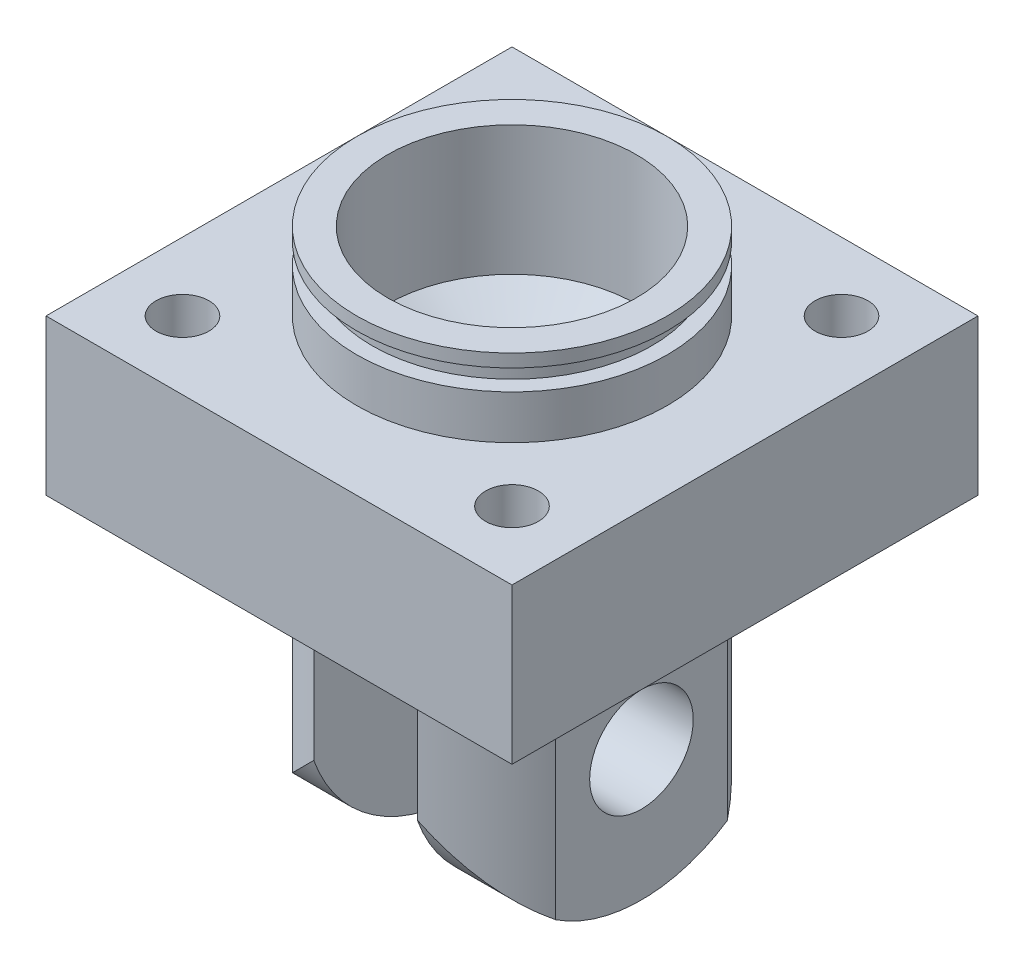
ISO-10303-21;
HEADER;
FILE_DESCRIPTION(('STEP AP214'),'2;1');
FILE_NAME('part.step','',(''),(''),'','','');
FILE_SCHEMA(('AUTOMOTIVE_DESIGN { 1 0 10303 214 1 1 1 1 }'));
ENDSEC;
DATA;
#1=APPLICATION_CONTEXT('core data for automotive mechanical design processes');
#2=APPLICATION_PROTOCOL_DEFINITION('international standard','automotive_design',2000,#1);
#3=PRODUCT_CONTEXT('',#1,'mechanical');
#4=PRODUCT('Part','Part','',(#3));
#5=PRODUCT_RELATED_PRODUCT_CATEGORY('part','',(#4));
#6=PRODUCT_DEFINITION_FORMATION('','',#4);
#7=PRODUCT_DEFINITION_CONTEXT('part definition',#1,'design');
#8=PRODUCT_DEFINITION('design','',#6,#7);
#9=PRODUCT_DEFINITION_SHAPE('','',#8);
#10=(LENGTH_UNIT() NAMED_UNIT(*) SI_UNIT(.MILLI.,.METRE.));
#11=(NAMED_UNIT(*) PLANE_ANGLE_UNIT() SI_UNIT($,.RADIAN.));
#12=(NAMED_UNIT(*) SI_UNIT($,.STERADIAN.) SOLID_ANGLE_UNIT());
#13=UNCERTAINTY_MEASURE_WITH_UNIT(LENGTH_MEASURE(1.E-05),#10,'distance_accuracy_value','');
#14=(GEOMETRIC_REPRESENTATION_CONTEXT(3) GLOBAL_UNCERTAINTY_ASSIGNED_CONTEXT((#13)) GLOBAL_UNIT_ASSIGNED_CONTEXT((#10,
#11,#12)) REPRESENTATION_CONTEXT('',''));
#15=CARTESIAN_POINT('',(0.,0.,0.));
#16=DIRECTION('',(0.,0.,1.));
#17=DIRECTION('',(1.,0.,0.));
#18=AXIS2_PLACEMENT_3D('',#15,#16,#17);
#19=CARTESIAN_POINT('',(0.,-70.2,0.));
#20=DIRECTION('',(0.,1.,0.));
#21=DIRECTION('',(0.,0.,1.));
#22=AXIS2_PLACEMENT_3D('',#19,#20,#21);
#23=CYLINDRICAL_SURFACE('',#22,30.);
#24=CARTESIAN_POINT('',(0.,-40.2,0.));
#25=DIRECTION('',(0.707106781186548,0.707106781186547,0.));
#26=DIRECTION('',(-0.707106781186548,0.707106781186547,0.));
#27=AXIS2_PLACEMENT_3D('',#24,#25,#26);
#28=ELLIPSE('',#27,42.4264068711928,30.);
#29=CARTESIAN_POINT('',(25.,-65.2,16.583123951777));
#30=VERTEX_POINT('',#29);
#31=CARTESIAN_POINT('',(10.,-50.2,28.2842712474619));
#32=VERTEX_POINT('',#31);
#33=EDGE_CURVE('E210',#30,#32,#28,.F.);
#34=ORIENTED_EDGE('',*,*,#33,.F.);
#35=DIRECTION('',(0.,1.,0.));
#36=VECTOR('',#35,1.);
#37=CARTESIAN_POINT('',(25.,-70.2,16.583123951777));
#38=LINE('',#37,#36);
#39=CARTESIAN_POINT('',(25.,-15.,16.583123951777));
#40=VERTEX_POINT('',#39);
#41=EDGE_CURVE('E253',#30,#40,#38,.T.);
#42=ORIENTED_EDGE('',*,*,#41,.T.);
#43=CARTESIAN_POINT('',(0.,-15.,0.));
#44=DIRECTION('',(0.,-1.,0.));
#45=DIRECTION('',(0.,0.,-1.));
#46=AXIS2_PLACEMENT_3D('',#43,#44,#45);
#47=CIRCLE('',#46,30.);
#48=CARTESIAN_POINT('',(10.,-15.,28.2842712474619));
#49=VERTEX_POINT('',#48);
#50=EDGE_CURVE('E284',#40,#49,#47,.T.);
#51=ORIENTED_EDGE('',*,*,#50,.T.);
#52=DIRECTION('',(0.,1.,0.));
#53=VECTOR('',#52,1.);
#54=CARTESIAN_POINT('',(10.,-70.2,28.2842712474619));
#55=LINE('',#54,#53);
#56=EDGE_CURVE('E273',#49,#32,#55,.F.);
#57=ORIENTED_EDGE('',*,*,#56,.T.);
#58=EDGE_LOOP('',(#34,#42,#51,#57));
#59=FACE_BOUND('',#58,.T.);
#60=ADVANCED_FACE('F46',(#59),#23,.T.);
#61=CARTESIAN_POINT('',(0.,-40.2,0.));
#62=DIRECTION('',(-0.707106781186548,0.707106781186547,0.));
#63=DIRECTION('',(0.707106781186548,0.707106781186547,0.));
#64=AXIS2_PLACEMENT_3D('',#61,#62,#63);
#65=ELLIPSE('',#64,42.4264068711928,30.);
#66=CARTESIAN_POINT('',(-25.,-65.2,-16.583123951777));
#67=VERTEX_POINT('',#66);
#68=CARTESIAN_POINT('',(-10.,-50.2,-28.2842712474619));
#69=VERTEX_POINT('',#68);
#70=EDGE_CURVE('E223',#67,#69,#65,.F.);
#71=ORIENTED_EDGE('',*,*,#70,.F.);
#72=DIRECTION('',(0.,1.,0.));
#73=VECTOR('',#72,1.);
#74=CARTESIAN_POINT('',(-25.,-70.2,-16.583123951777));
#75=LINE('',#74,#73);
#76=CARTESIAN_POINT('',(-25.,-15.,-16.583123951777));
#77=VERTEX_POINT('',#76);
#78=EDGE_CURVE('E242',#67,#77,#75,.T.);
#79=ORIENTED_EDGE('',*,*,#78,.T.);
#80=CARTESIAN_POINT('',(-10.,-15.,-28.2842712474619));
#81=VERTEX_POINT('',#80);
#82=EDGE_CURVE('E302',#77,#81,#47,.T.);
#83=ORIENTED_EDGE('',*,*,#82,.T.);
#84=DIRECTION('',(0.,1.,0.));
#85=VECTOR('',#84,1.);
#86=CARTESIAN_POINT('',(-10.,-70.2,-28.2842712474619));
#87=LINE('',#86,#85);
#88=EDGE_CURVE('E265',#81,#69,#87,.F.);
#89=ORIENTED_EDGE('',*,*,#88,.T.);
#90=EDGE_LOOP('',(#71,#79,#83,#89));
#91=FACE_BOUND('',#90,.T.);
#92=ADVANCED_FACE('F386',(#91),#23,.T.);
#93=CARTESIAN_POINT('',(0.,-40.2,0.));
#94=DIRECTION('',(0.707106781186548,0.707106781186547,0.));
#95=DIRECTION('',(-0.707106781186548,0.707106781186547,0.));
#96=AXIS2_PLACEMENT_3D('',#93,#94,#95);
#97=ELLIPSE('',#96,42.4264068711928,30.);
#98=CARTESIAN_POINT('',(10.,-50.2,-28.2842712474619));
#99=VERTEX_POINT('',#98);
#100=CARTESIAN_POINT('',(25.,-65.2,-16.583123951777));
#101=VERTEX_POINT('',#100);
#102=EDGE_CURVE('E206',#99,#101,#97,.F.);
#103=ORIENTED_EDGE('',*,*,#102,.F.);
#104=DIRECTION('',(0.,1.,0.));
#105=VECTOR('',#104,1.);
#106=CARTESIAN_POINT('',(10.,-70.2,-28.2842712474619));
#107=LINE('',#106,#105);
#108=CARTESIAN_POINT('',(10.,-15.,-28.2842712474619));
#109=VERTEX_POINT('',#108);
#110=EDGE_CURVE('E277',#99,#109,#107,.T.);
#111=ORIENTED_EDGE('',*,*,#110,.T.);
#112=CARTESIAN_POINT('',(25.,-15.,-16.583123951777));
#113=VERTEX_POINT('',#112);
#114=EDGE_CURVE('E57',#109,#113,#47,.T.);
#115=ORIENTED_EDGE('',*,*,#114,.T.);
#116=DIRECTION('',(0.,1.,0.));
#117=VECTOR('',#116,1.);
#118=CARTESIAN_POINT('',(25.,-70.2,-16.583123951777));
#119=LINE('',#118,#117);
#120=EDGE_CURVE('E249',#113,#101,#119,.F.);
#121=ORIENTED_EDGE('',*,*,#120,.T.);
#122=EDGE_LOOP('',(#103,#111,#115,#121));
#123=FACE_BOUND('',#122,.T.);
#124=ADVANCED_FACE('F418',(#123),#23,.T.);
#125=CARTESIAN_POINT('',(0.,-40.2,0.));
#126=DIRECTION('',(-0.707106781186548,0.707106781186547,0.));
#127=DIRECTION('',(0.707106781186548,0.707106781186547,0.));
#128=AXIS2_PLACEMENT_3D('',#125,#126,#127);
#129=ELLIPSE('',#128,42.4264068711928,30.);
#130=CARTESIAN_POINT('',(-10.,-50.2,28.2842712474619));
#131=VERTEX_POINT('',#130);
#132=CARTESIAN_POINT('',(-25.,-65.2,16.583123951777));
#133=VERTEX_POINT('',#132);
#134=EDGE_CURVE('E219',#131,#133,#129,.F.);
#135=ORIENTED_EDGE('',*,*,#134,.F.);
#136=DIRECTION('',(0.,1.,0.));
#137=VECTOR('',#136,1.);
#138=CARTESIAN_POINT('',(-10.,-70.2,28.2842712474619));
#139=LINE('',#138,#137);
#140=CARTESIAN_POINT('',(-10.,-15.,28.2842712474619));
#141=VERTEX_POINT('',#140);
#142=EDGE_CURVE('E269',#131,#141,#139,.T.);
#143=ORIENTED_EDGE('',*,*,#142,.T.);
#144=CARTESIAN_POINT('',(-25.,-15.,16.583123951777));
#145=VERTEX_POINT('',#144);
#146=EDGE_CURVE('E285',#141,#145,#47,.T.);
#147=ORIENTED_EDGE('',*,*,#146,.T.);
#148=DIRECTION('',(0.,1.,0.));
#149=VECTOR('',#148,1.);
#150=CARTESIAN_POINT('',(-25.,-70.2,16.583123951777));
#151=LINE('',#150,#149);
#152=EDGE_CURVE('E238',#145,#133,#151,.F.);
#153=ORIENTED_EDGE('',*,*,#152,.T.);
#154=EDGE_LOOP('',(#135,#143,#147,#153));
#155=FACE_BOUND('',#154,.T.);
#156=ADVANCED_FACE('F376',(#155),#23,.T.);
#157=CARTESIAN_POINT('',(10.,-15.,32.1559805024373));
#158=DIRECTION('',(1.,0.,0.));
#159=DIRECTION('',(0.,0.,-1.));
#160=AXIS2_PLACEMENT_3D('',#157,#158,#159);
#161=PLANE('',#160);
#162=CARTESIAN_POINT('',(10.,-45.,0.));
#163=DIRECTION('',(1.,0.,0.));
#164=DIRECTION('',(0.,0.,-1.));
#165=AXIS2_PLACEMENT_3D('',#162,#163,#164);
#166=CIRCLE('',#165,10.);
#167=CARTESIAN_POINT('',(10.,-45.,-10.));
#168=VERTEX_POINT('',#167);
#169=EDGE_CURVE('E272',#168,#168,#166,.F.);
#170=ORIENTED_EDGE('',*,*,#169,.F.);
#171=EDGE_LOOP('',(#170));
#172=FACE_BOUND('',#171,.T.);
#173=CARTESIAN_POINT('',(10.,-40.2,0.));
#174=DIRECTION('',(1.,0.,0.));
#175=DIRECTION('',(0.,0.,-1.));
#176=AXIS2_PLACEMENT_3D('',#173,#174,#175);
#177=CIRCLE('',#176,30.);
#178=EDGE_CURVE('E213',#32,#99,#177,.T.);
#179=ORIENTED_EDGE('',*,*,#178,.F.);
#180=ORIENTED_EDGE('',*,*,#56,.F.);
#181=DIRECTION('',(0.,0.,1.));
#182=VECTOR('',#181,1.);
#183=CARTESIAN_POINT('',(10.,-15.,32.1559805024373));
#184=LINE('',#183,#182);
#185=EDGE_CURVE('E256',#109,#49,#184,.T.);
#186=ORIENTED_EDGE('',*,*,#185,.F.);
#187=ORIENTED_EDGE('',*,*,#110,.F.);
#188=EDGE_LOOP('',(#179,#180,#186,#187));
#189=FACE_BOUND('',#188,.T.);
#190=ADVANCED_FACE('F423',(#172,#189),#161,.F.);
#191=CARTESIAN_POINT('',(-10.,-15.,32.1559805024373));
#192=DIRECTION('',(-1.,0.,0.));
#193=DIRECTION('',(0.,0.,1.));
#194=AXIS2_PLACEMENT_3D('',#191,#192,#193);
#195=PLANE('',#194);
#196=CARTESIAN_POINT('',(-10.,-45.,0.));
#197=DIRECTION('',(-1.,0.,0.));
#198=DIRECTION('',(0.,0.,1.));
#199=AXIS2_PLACEMENT_3D('',#196,#197,#198);
#200=CIRCLE('',#199,10.);
#201=CARTESIAN_POINT('',(-10.,-45.,10.));
#202=VERTEX_POINT('',#201);
#203=EDGE_CURVE('E264',#202,#202,#200,.F.);
#204=ORIENTED_EDGE('',*,*,#203,.F.);
#205=EDGE_LOOP('',(#204));
#206=FACE_BOUND('',#205,.T.);
#207=CARTESIAN_POINT('',(-10.,-40.2,0.));
#208=DIRECTION('',(-1.,0.,0.));
#209=DIRECTION('',(0.,0.,1.));
#210=AXIS2_PLACEMENT_3D('',#207,#208,#209);
#211=CIRCLE('',#210,30.);
#212=EDGE_CURVE('E226',#69,#131,#211,.T.);
#213=ORIENTED_EDGE('',*,*,#212,.F.);
#214=ORIENTED_EDGE('',*,*,#88,.F.);
#215=DIRECTION('',(0.,0.,-1.));
#216=VECTOR('',#215,1.);
#217=CARTESIAN_POINT('',(-10.,-15.,32.1559805024373));
#218=LINE('',#217,#216);
#219=EDGE_CURVE('E260',#141,#81,#218,.T.);
#220=ORIENTED_EDGE('',*,*,#219,.F.);
#221=ORIENTED_EDGE('',*,*,#142,.F.);
#222=EDGE_LOOP('',(#213,#214,#220,#221));
#223=FACE_BOUND('',#222,.T.);
#224=ADVANCED_FACE('F364',(#206,#223),#195,.F.);
#225=CARTESIAN_POINT('',(-25.,-75.,-36.8353955755532));
#226=DIRECTION('',(1.,0.,0.));
#227=DIRECTION('',(0.,0.,-1.));
#228=AXIS2_PLACEMENT_3D('',#225,#226,#227);
#229=PLANE('',#228);
#230=CARTESIAN_POINT('',(-25.,-45.,0.));
#231=DIRECTION('',(1.,0.,0.));
#232=DIRECTION('',(0.,0.,-1.));
#233=AXIS2_PLACEMENT_3D('',#230,#231,#232);
#234=CIRCLE('',#233,10.);
#235=CARTESIAN_POINT('',(-25.,-45.,-10.));
#236=VERTEX_POINT('',#235);
#237=EDGE_CURVE('E237',#236,#236,#234,.F.);
#238=ORIENTED_EDGE('',*,*,#237,.F.);
#239=EDGE_LOOP('',(#238));
#240=FACE_BOUND('',#239,.T.);
#241=CARTESIAN_POINT('',(-25.,-40.2,0.));
#242=DIRECTION('',(1.,0.,0.));
#243=DIRECTION('',(0.,0.,-1.));
#244=AXIS2_PLACEMENT_3D('',#241,#242,#243);
#245=CIRCLE('',#244,30.);
#246=EDGE_CURVE('E216',#133,#67,#245,.T.);
#247=ORIENTED_EDGE('',*,*,#246,.F.);
#248=ORIENTED_EDGE('',*,*,#152,.F.);
#249=DIRECTION('',(0.,0.,-1.));
#250=VECTOR('',#249,1.);
#251=CARTESIAN_POINT('',(-25.,-15.,-36.8353955755532));
#252=LINE('',#251,#250);
#253=EDGE_CURVE('E233',#145,#77,#252,.T.);
#254=ORIENTED_EDGE('',*,*,#253,.T.);
#255=ORIENTED_EDGE('',*,*,#78,.F.);
#256=EDGE_LOOP('',(#247,#248,#254,#255));
#257=FACE_BOUND('',#256,.T.);
#258=ADVANCED_FACE('F360',(#240,#257),#229,.F.);
#259=CARTESIAN_POINT('',(25.,-75.,-36.8353955755532));
#260=DIRECTION('',(-1.,0.,0.));
#261=DIRECTION('',(0.,0.,1.));
#262=AXIS2_PLACEMENT_3D('',#259,#260,#261);
#263=PLANE('',#262);
#264=CARTESIAN_POINT('',(25.,-45.,0.));
#265=DIRECTION('',(-1.,0.,0.));
#266=DIRECTION('',(0.,0.,1.));
#267=AXIS2_PLACEMENT_3D('',#264,#265,#266);
#268=CIRCLE('',#267,10.);
#269=CARTESIAN_POINT('',(25.,-45.,10.));
#270=VERTEX_POINT('',#269);
#271=EDGE_CURVE('E245',#270,#270,#268,.F.);
#272=ORIENTED_EDGE('',*,*,#271,.F.);
#273=EDGE_LOOP('',(#272));
#274=FACE_BOUND('',#273,.T.);
#275=CARTESIAN_POINT('',(25.,-40.2,0.));
#276=DIRECTION('',(-1.,0.,0.));
#277=DIRECTION('',(0.,0.,1.));
#278=AXIS2_PLACEMENT_3D('',#275,#276,#277);
#279=CIRCLE('',#278,30.);
#280=EDGE_CURVE('E12',#101,#30,#279,.T.);
#281=ORIENTED_EDGE('',*,*,#280,.F.);
#282=ORIENTED_EDGE('',*,*,#120,.F.);
#283=DIRECTION('',(0.,0.,1.));
#284=VECTOR('',#283,1.);
#285=CARTESIAN_POINT('',(25.,-15.,-36.8353955755532));
#286=LINE('',#285,#284);
#287=EDGE_CURVE('E229',#113,#40,#286,.T.);
#288=ORIENTED_EDGE('',*,*,#287,.T.);
#289=ORIENTED_EDGE('',*,*,#41,.F.);
#290=EDGE_LOOP('',(#281,#282,#288,#289));
#291=FACE_BOUND('',#290,.T.);
#292=ADVANCED_FACE('F363',(#274,#291),#263,.F.);
#293=CARTESIAN_POINT('',(-45.,-45.,0.));
#294=DIRECTION('',(1.,0.,0.));
#295=DIRECTION('',(0.,0.,-1.));
#296=AXIS2_PLACEMENT_3D('',#293,#294,#295);
#297=CYLINDRICAL_SURFACE('',#296,10.);
#298=ORIENTED_EDGE('',*,*,#271,.T.);
#299=EDGE_LOOP('',(#298));
#300=FACE_BOUND('',#299,.T.);
#301=ORIENTED_EDGE('',*,*,#169,.T.);
#302=EDGE_LOOP('',(#301));
#303=FACE_BOUND('',#302,.T.);
#304=ADVANCED_FACE('F411',(#300,#303),#297,.F.);
#305=CARTESIAN_POINT('',(-45.,15.,45.));
#306=DIRECTION('',(0.,0.,-1.));
#307=DIRECTION('',(-1.,0.,0.));
#308=AXIS2_PLACEMENT_3D('',#305,#306,#307);
#309=PLANE('',#308);
#310=DIRECTION('',(1.,0.,0.));
#311=VECTOR('',#310,1.);
#312=CARTESIAN_POINT('',(-45.,-15.,45.));
#313=LINE('',#312,#311);
#314=CARTESIAN_POINT('',(-45.,-15.,45.));
#315=VERTEX_POINT('',#314);
#316=CARTESIAN_POINT('',(45.,-15.,45.));
#317=VERTEX_POINT('',#316);
#318=EDGE_CURVE('E307',#315,#317,#313,.T.);
#319=ORIENTED_EDGE('',*,*,#318,.T.);
#320=DIRECTION('',(0.,-1.,0.));
#321=VECTOR('',#320,1.);
#322=CARTESIAN_POINT('',(45.,15.,45.));
#323=LINE('',#322,#321);
#324=CARTESIAN_POINT('',(45.,15.,45.));
#325=VERTEX_POINT('',#324);
#326=EDGE_CURVE('E311',#325,#317,#323,.T.);
#327=ORIENTED_EDGE('',*,*,#326,.F.);
#328=DIRECTION('',(1.,0.,0.));
#329=VECTOR('',#328,1.);
#330=CARTESIAN_POINT('',(-45.,15.,45.));
#331=LINE('',#330,#329);
#332=CARTESIAN_POINT('',(-45.,15.,45.));
#333=VERTEX_POINT('',#332);
#334=EDGE_CURVE('E90',#333,#325,#331,.T.);
#335=ORIENTED_EDGE('',*,*,#334,.F.);
#336=DIRECTION('',(0.,-1.,0.));
#337=VECTOR('',#336,1.);
#338=CARTESIAN_POINT('',(-45.,15.,45.));
#339=LINE('',#338,#337);
#340=EDGE_CURVE('E324',#333,#315,#339,.T.);
#341=ORIENTED_EDGE('',*,*,#340,.T.);
#342=EDGE_LOOP('',(#319,#327,#335,#341));
#343=FACE_BOUND('',#342,.T.);
#344=ADVANCED_FACE('F48',(#343),#309,.F.);
#345=CARTESIAN_POINT('',(45.,15.,-45.));
#346=DIRECTION('',(1.,0.,0.));
#347=DIRECTION('',(0.,0.,-1.));
#348=AXIS2_PLACEMENT_3D('',#345,#346,#347);
#349=PLANE('',#348);
#350=DIRECTION('',(0.,0.,1.));
#351=VECTOR('',#350,1.);
#352=CARTESIAN_POINT('',(45.,-15.,-45.));
#353=LINE('',#352,#351);
#354=CARTESIAN_POINT('',(45.,-15.,-45.));
#355=VERTEX_POINT('',#354);
#356=EDGE_CURVE('E328',#355,#317,#353,.T.);
#357=ORIENTED_EDGE('',*,*,#356,.F.);
#358=DIRECTION('',(0.,-1.,0.));
#359=VECTOR('',#358,1.);
#360=CARTESIAN_POINT('',(45.,15.,-45.));
#361=LINE('',#360,#359);
#362=CARTESIAN_POINT('',(45.,15.,-45.));
#363=VERTEX_POINT('',#362);
#364=EDGE_CURVE('E342',#363,#355,#361,.T.);
#365=ORIENTED_EDGE('',*,*,#364,.F.);
#366=DIRECTION('',(0.,0.,1.));
#367=VECTOR('',#366,1.);
#368=CARTESIAN_POINT('',(45.,15.,-45.));
#369=LINE('',#368,#367);
#370=EDGE_CURVE('E314',#363,#325,#369,.T.);
#371=ORIENTED_EDGE('',*,*,#370,.T.);
#372=ORIENTED_EDGE('',*,*,#326,.T.);
#373=EDGE_LOOP('',(#357,#365,#371,#372));
#374=FACE_BOUND('',#373,.T.);
#375=ADVANCED_FACE('F403',(#374),#349,.T.);
#376=CARTESIAN_POINT('',(-45.,15.,-45.));
#377=DIRECTION('',(0.,0.,-1.));
#378=DIRECTION('',(-1.,0.,0.));
#379=AXIS2_PLACEMENT_3D('',#376,#377,#378);
#380=PLANE('',#379);
#381=CARTESIAN_POINT('',(0.,0.,-45.));
#382=DIRECTION('',(0.,0.,-1.));
#383=DIRECTION('',(-1.,0.,0.));
#384=AXIS2_PLACEMENT_3D('',#381,#382,#383);
#385=CIRCLE('',#384,7.24999999999999);
#386=CARTESIAN_POINT('',(-7.24999999999999,0.,-45.));
#387=VERTEX_POINT('',#386);
#388=EDGE_CURVE('E796',#387,#387,#385,.T.);
#389=ORIENTED_EDGE('',*,*,#388,.F.);
#390=EDGE_LOOP('',(#389));
#391=FACE_BOUND('',#390,.T.);
#392=DIRECTION('',(1.,0.,0.));
#393=VECTOR('',#392,1.);
#394=CARTESIAN_POINT('',(-45.,-15.,-45.));
#395=LINE('',#394,#393);
#396=CARTESIAN_POINT('',(-45.,-15.,-45.));
#397=VERTEX_POINT('',#396);
#398=EDGE_CURVE('E332',#397,#355,#395,.T.);
#399=ORIENTED_EDGE('',*,*,#398,.F.);
#400=DIRECTION('',(0.,-1.,0.));
#401=VECTOR('',#400,1.);
#402=CARTESIAN_POINT('',(-45.,15.,-45.));
#403=LINE('',#402,#401);
#404=CARTESIAN_POINT('',(-45.,15.,-45.));
#405=VERTEX_POINT('',#404);
#406=EDGE_CURVE('E82',#405,#397,#403,.T.);
#407=ORIENTED_EDGE('',*,*,#406,.F.);
#408=DIRECTION('',(1.,0.,0.));
#409=VECTOR('',#408,1.);
#410=CARTESIAN_POINT('',(-45.,15.,-45.));
#411=LINE('',#410,#409);
#412=EDGE_CURVE('E318',#405,#363,#411,.T.);
#413=ORIENTED_EDGE('',*,*,#412,.T.);
#414=ORIENTED_EDGE('',*,*,#364,.T.);
#415=EDGE_LOOP('',(#399,#407,#413,#414));
#416=FACE_BOUND('',#415,.T.);
#417=ADVANCED_FACE('F401',(#391,#416),#380,.T.);
#418=CARTESIAN_POINT('',(-45.,15.,-45.));
#419=DIRECTION('',(1.,0.,0.));
#420=DIRECTION('',(0.,0.,-1.));
#421=AXIS2_PLACEMENT_3D('',#418,#419,#420);
#422=PLANE('',#421);
#423=DIRECTION('',(0.,0.,1.));
#424=VECTOR('',#423,1.);
#425=CARTESIAN_POINT('',(-45.,-15.,-45.));
#426=LINE('',#425,#424);
#427=EDGE_CURVE('E85',#397,#315,#426,.T.);
#428=ORIENTED_EDGE('',*,*,#427,.T.);
#429=ORIENTED_EDGE('',*,*,#340,.F.);
#430=DIRECTION('',(0.,0.,1.));
#431=VECTOR('',#430,1.);
#432=CARTESIAN_POINT('',(-45.,15.,-45.));
#433=LINE('',#432,#431);
#434=EDGE_CURVE('E65',#405,#333,#433,.T.);
#435=ORIENTED_EDGE('',*,*,#434,.F.);
#436=ORIENTED_EDGE('',*,*,#406,.T.);
#437=EDGE_LOOP('',(#428,#429,#435,#436));
#438=FACE_BOUND('',#437,.T.);
#439=ADVANCED_FACE('F399',(#438),#422,.F.);
#440=CARTESIAN_POINT('',(0.,15.,0.));
#441=DIRECTION('',(0.,-1.,0.));
#442=DIRECTION('',(0.,0.,-1.));
#443=AXIS2_PLACEMENT_3D('',#440,#441,#442);
#444=PLANE('',#443);
#445=CARTESIAN_POINT('',(-31.8198051533943,15.,-31.819805153395));
#446=DIRECTION('',(0.,1.,0.));
#447=DIRECTION('',(0.,0.,1.));
#448=AXIS2_PLACEMENT_3D('',#445,#446,#447);
#449=CIRCLE('',#448,5.1);
#450=CARTESIAN_POINT('',(-31.8198051533943,15.,-26.719805153395));
#451=VERTEX_POINT('',#450);
#452=EDGE_CURVE('E167',#451,#451,#449,.T.);
#453=ORIENTED_EDGE('',*,*,#452,.F.);
#454=EDGE_LOOP('',(#453));
#455=FACE_BOUND('',#454,.T.);
#456=CARTESIAN_POINT('',(-31.8198051533946,15.,31.8198051533947));
#457=DIRECTION('',(0.,1.,0.));
#458=DIRECTION('',(0.,0.,1.));
#459=AXIS2_PLACEMENT_3D('',#456,#457,#458);
#460=CIRCLE('',#459,5.1);
#461=CARTESIAN_POINT('',(-31.8198051533946,15.,36.9198051533946));
#462=VERTEX_POINT('',#461);
#463=EDGE_CURVE('E166',#462,#462,#460,.T.);
#464=ORIENTED_EDGE('',*,*,#463,.F.);
#465=EDGE_LOOP('',(#464));
#466=FACE_BOUND('',#465,.T.);
#467=CARTESIAN_POINT('',(31.8198051533945,15.,31.8198051533947));
#468=DIRECTION('',(0.,1.,0.));
#469=DIRECTION('',(0.,0.,1.));
#470=AXIS2_PLACEMENT_3D('',#467,#468,#469);
#471=CIRCLE('',#470,5.1);
#472=CARTESIAN_POINT('',(31.8198051533945,15.,36.9198051533947));
#473=VERTEX_POINT('',#472);
#474=EDGE_CURVE('E182',#473,#473,#471,.T.);
#475=ORIENTED_EDGE('',*,*,#474,.F.);
#476=EDGE_LOOP('',(#475));
#477=FACE_BOUND('',#476,.T.);
#478=CARTESIAN_POINT('',(31.8198051533946,15.,-31.8198051533947));
#479=DIRECTION('',(0.,1.,0.));
#480=DIRECTION('',(0.,0.,1.));
#481=AXIS2_PLACEMENT_3D('',#478,#479,#480);
#482=CIRCLE('',#481,5.1);
#483=CARTESIAN_POINT('',(31.8198051533946,15.,-26.7198051533946));
#484=VERTEX_POINT('',#483);
#485=EDGE_CURVE('E190',#484,#484,#482,.T.);
#486=ORIENTED_EDGE('',*,*,#485,.F.);
#487=EDGE_LOOP('',(#486));
#488=FACE_BOUND('',#487,.T.);
#489=CARTESIAN_POINT('',(0.,15.,0.));
#490=DIRECTION('',(0.,1.,0.));
#491=DIRECTION('',(0.,0.,1.));
#492=AXIS2_PLACEMENT_3D('',#489,#490,#491);
#493=CIRCLE('',#492,30.);
#494=CARTESIAN_POINT('',(0.,15.,30.));
#495=VERTEX_POINT('',#494);
#496=EDGE_CURVE('E303',#495,#495,#493,.T.);
#497=ORIENTED_EDGE('',*,*,#496,.F.);
#498=EDGE_LOOP('',(#497));
#499=FACE_BOUND('',#498,.T.);
#500=ORIENTED_EDGE('',*,*,#334,.T.);
#501=ORIENTED_EDGE('',*,*,#370,.F.);
#502=ORIENTED_EDGE('',*,*,#412,.F.);
#503=ORIENTED_EDGE('',*,*,#434,.T.);
#504=EDGE_LOOP('',(#500,#501,#502,#503));
#505=FACE_BOUND('',#504,.T.);
#506=ADVANCED_FACE('F392',(#455,#466,#477,#488,#499,#505),#444,.F.);
#507=CARTESIAN_POINT('',(0.,-15.,0.));
#508=DIRECTION('',(0.,-1.,0.));
#509=DIRECTION('',(0.,0.,-1.));
#510=AXIS2_PLACEMENT_3D('',#507,#508,#509);
#511=PLANE('',#510);
#512=ORIENTED_EDGE('',*,*,#50,.F.);
#513=ORIENTED_EDGE('',*,*,#287,.F.);
#514=ORIENTED_EDGE('',*,*,#114,.F.);
#515=ORIENTED_EDGE('',*,*,#185,.T.);
#516=EDGE_LOOP('',(#512,#513,#514,#515));
#517=FACE_BOUND('',#516,.T.);
#518=ORIENTED_EDGE('',*,*,#82,.F.);
#519=ORIENTED_EDGE('',*,*,#253,.F.);
#520=ORIENTED_EDGE('',*,*,#146,.F.);
#521=ORIENTED_EDGE('',*,*,#219,.T.);
#522=EDGE_LOOP('',(#518,#519,#520,#521));
#523=FACE_BOUND('',#522,.T.);
#524=ORIENTED_EDGE('',*,*,#318,.F.);
#525=ORIENTED_EDGE('',*,*,#427,.F.);
#526=ORIENTED_EDGE('',*,*,#398,.T.);
#527=ORIENTED_EDGE('',*,*,#356,.T.);
#528=EDGE_LOOP('',(#524,#525,#526,#527));
#529=FACE_BOUND('',#528,.T.);
#530=ADVANCED_FACE('F388',(#517,#523,#529),#511,.T.);
#531=CARTESIAN_POINT('',(0.,23.5,0.));
#532=DIRECTION('',(0.,-1.,0.));
#533=DIRECTION('',(0.,0.,-1.));
#534=AXIS2_PLACEMENT_3D('',#531,#532,#533);
#535=CYLINDRICAL_SURFACE('',#534,30.);
#536=CARTESIAN_POINT('',(0.,23.5,0.));
#537=DIRECTION('',(0.,1.,0.));
#538=DIRECTION('',(0.,0.,1.));
#539=AXIS2_PLACEMENT_3D('',#536,#537,#538);
#540=CIRCLE('',#539,30.);
#541=CARTESIAN_POINT('',(0.,23.5,30.));
#542=VERTEX_POINT('',#541);
#543=EDGE_CURVE('E297',#542,#542,#540,.T.);
#544=ORIENTED_EDGE('',*,*,#543,.F.);
#545=EDGE_LOOP('',(#544));
#546=FACE_BOUND('',#545,.T.);
#547=ORIENTED_EDGE('',*,*,#496,.T.);
#548=EDGE_LOOP('',(#547));
#549=FACE_BOUND('',#548,.T.);
#550=ADVANCED_FACE('F391',(#546,#549),#535,.T.);
#551=CARTESIAN_POINT('',(0.,23.5,0.));
#552=DIRECTION('',(0.,1.,0.));
#553=DIRECTION('',(0.,0.,1.));
#554=AXIS2_PLACEMENT_3D('',#551,#552,#553);
#555=PLANE('',#554);
#556=CARTESIAN_POINT('',(0.,23.5,0.));
#557=DIRECTION('',(0.,1.,0.));
#558=DIRECTION('',(0.,0.,1.));
#559=AXIS2_PLACEMENT_3D('',#556,#557,#558);
#560=CIRCLE('',#559,27.);
#561=CARTESIAN_POINT('',(0.,23.5,27.));
#562=VERTEX_POINT('',#561);
#563=EDGE_CURVE('E298',#562,#562,#560,.T.);
#564=ORIENTED_EDGE('',*,*,#563,.F.);
#565=EDGE_LOOP('',(#564));
#566=FACE_BOUND('',#565,.T.);
#567=ORIENTED_EDGE('',*,*,#543,.T.);
#568=EDGE_LOOP('',(#567));
#569=FACE_BOUND('',#568,.T.);
#570=ADVANCED_FACE('F512',(#566,#569),#555,.T.);
#571=CARTESIAN_POINT('',(0.,27.5,0.));
#572=DIRECTION('',(0.,-1.,0.));
#573=DIRECTION('',(0.,0.,-1.));
#574=AXIS2_PLACEMENT_3D('',#571,#572,#573);
#575=CYLINDRICAL_SURFACE('',#574,27.);
#576=CARTESIAN_POINT('',(0.,27.5,0.));
#577=DIRECTION('',(0.,1.,0.));
#578=DIRECTION('',(0.,0.,1.));
#579=AXIS2_PLACEMENT_3D('',#576,#577,#578);
#580=CIRCLE('',#579,27.);
#581=CARTESIAN_POINT('',(0.,27.5,27.));
#582=VERTEX_POINT('',#581);
#583=EDGE_CURVE('E290',#582,#582,#580,.T.);
#584=ORIENTED_EDGE('',*,*,#583,.F.);
#585=EDGE_LOOP('',(#584));
#586=FACE_BOUND('',#585,.T.);
#587=ORIENTED_EDGE('',*,*,#563,.T.);
#588=EDGE_LOOP('',(#587));
#589=FACE_BOUND('',#588,.T.);
#590=ADVANCED_FACE('F523',(#586,#589),#575,.T.);
#591=CARTESIAN_POINT('',(0.,30.,0.));
#592=DIRECTION('',(0.,-1.,0.));
#593=DIRECTION('',(0.,0.,-1.));
#594=AXIS2_PLACEMENT_3D('',#591,#592,#593);
#595=CYLINDRICAL_SURFACE('',#594,30.);
#596=CARTESIAN_POINT('',(0.,30.,0.));
#597=DIRECTION('',(0.,1.,0.));
#598=DIRECTION('',(0.,0.,1.));
#599=AXIS2_PLACEMENT_3D('',#596,#597,#598);
#600=CIRCLE('',#599,30.);
#601=CARTESIAN_POINT('',(0.,30.,30.));
#602=VERTEX_POINT('',#601);
#603=EDGE_CURVE('E286',#602,#602,#600,.T.);
#604=ORIENTED_EDGE('',*,*,#603,.F.);
#605=EDGE_LOOP('',(#604));
#606=FACE_BOUND('',#605,.T.);
#607=CARTESIAN_POINT('',(0.,27.5,0.));
#608=DIRECTION('',(0.,1.,0.));
#609=DIRECTION('',(0.,0.,1.));
#610=AXIS2_PLACEMENT_3D('',#607,#608,#609);
#611=CIRCLE('',#610,30.);
#612=CARTESIAN_POINT('',(0.,27.5,30.));
#613=VERTEX_POINT('',#612);
#614=EDGE_CURVE('E280',#613,#613,#611,.T.);
#615=ORIENTED_EDGE('',*,*,#614,.T.);
#616=EDGE_LOOP('',(#615));
#617=FACE_BOUND('',#616,.T.);
#618=ADVANCED_FACE('F533',(#606,#617),#595,.T.);
#619=CARTESIAN_POINT('',(0.,30.,0.));
#620=DIRECTION('',(0.,1.,0.));
#621=DIRECTION('',(0.,0.,1.));
#622=AXIS2_PLACEMENT_3D('',#619,#620,#621);
#623=PLANE('',#622);
#624=CARTESIAN_POINT('',(0.,30.,0.));
#625=DIRECTION('',(0.,1.,0.));
#626=DIRECTION('',(0.,0.,1.));
#627=AXIS2_PLACEMENT_3D('',#624,#625,#626);
#628=CIRCLE('',#627,24.);
#629=CARTESIAN_POINT('',(0.,30.,24.));
#630=VERTEX_POINT('',#629);
#631=EDGE_CURVE('E198',#630,#630,#628,.T.);
#632=ORIENTED_EDGE('',*,*,#631,.F.);
#633=EDGE_LOOP('',(#632));
#634=FACE_BOUND('',#633,.T.);
#635=ORIENTED_EDGE('',*,*,#603,.T.);
#636=EDGE_LOOP('',(#635));
#637=FACE_BOUND('',#636,.T.);
#638=ADVANCED_FACE('F542',(#634,#637),#623,.T.);
#639=CARTESIAN_POINT('',(0.,27.5,0.));
#640=DIRECTION('',(0.,1.,0.));
#641=DIRECTION('',(0.,0.,1.));
#642=AXIS2_PLACEMENT_3D('',#639,#640,#641);
#643=PLANE('',#642);
#644=ORIENTED_EDGE('',*,*,#583,.T.);
#645=EDGE_LOOP('',(#644));
#646=FACE_BOUND('',#645,.T.);
#647=ORIENTED_EDGE('',*,*,#614,.F.);
#648=EDGE_LOOP('',(#647));
#649=FACE_BOUND('',#648,.T.);
#650=ADVANCED_FACE('F453',(#646,#649),#643,.F.);
#651=ORIENTED_EDGE('',*,*,#237,.T.);
#652=EDGE_LOOP('',(#651));
#653=FACE_BOUND('',#652,.T.);
#654=ORIENTED_EDGE('',*,*,#203,.T.);
#655=EDGE_LOOP('',(#654));
#656=FACE_BOUND('',#655,.T.);
#657=ADVANCED_FACE('F357',(#653,#656),#297,.F.);
#658=CARTESIAN_POINT('',(-45.,-40.2,0.));
#659=DIRECTION('',(1.,0.,0.));
#660=DIRECTION('',(0.,0.,-1.));
#661=AXIS2_PLACEMENT_3D('',#658,#659,#660);
#662=CYLINDRICAL_SURFACE('',#661,30.);
#663=ORIENTED_EDGE('',*,*,#178,.T.);
#664=ORIENTED_EDGE('',*,*,#102,.T.);
#665=ORIENTED_EDGE('',*,*,#280,.T.);
#666=ORIENTED_EDGE('',*,*,#33,.T.);
#667=EDGE_LOOP('',(#663,#664,#665,#666));
#668=FACE_BOUND('',#667,.T.);
#669=ADVANCED_FACE('F445',(#668),#662,.T.);
#670=ORIENTED_EDGE('',*,*,#134,.T.);
#671=ORIENTED_EDGE('',*,*,#246,.T.);
#672=ORIENTED_EDGE('',*,*,#70,.T.);
#673=ORIENTED_EDGE('',*,*,#212,.T.);
#674=EDGE_LOOP('',(#670,#671,#672,#673));
#675=FACE_BOUND('',#674,.T.);
#676=ADVANCED_FACE('F371',(#675),#662,.T.);
#677=CARTESIAN_POINT('',(0.,4.99999999999999,0.));
#678=DIRECTION('',(0.,1.,0.));
#679=DIRECTION('',(0.,0.,1.));
#680=AXIS2_PLACEMENT_3D('',#677,#678,#679);
#681=CONICAL_SURFACE('',#680,24.,1.02974425867665);
#682=CARTESIAN_POINT('',(-0.0919386651073646,1.69751208659241,-18.5035087165975));
#683=CARTESIAN_POINT('',(-0.0436504159850991,1.7001226548679,-18.508092932183));
#684=CARTESIAN_POINT('',(0.00515199895115057,1.70068281597582,-18.5090767732358));
#685=CARTESIAN_POINT('',(0.102270628133471,1.69761976257955,-18.5036977734173));
#686=CARTESIAN_POINT('',(0.150585762529451,1.69398872321894,-18.4973211908364));
#687=CARTESIAN_POINT('',(0.245081026999239,1.68291042277819,-18.4778710197056));
#688=CARTESIAN_POINT('',(0.291271476880146,1.67548435417122,-18.464834621513));
#689=CARTESIAN_POINT('',(0.38094909965192,1.65740020711399,-18.4330990704754));
#690=CARTESIAN_POINT('',(0.424435655944837,1.64674139469997,-18.4143986316652));
#691=CARTESIAN_POINT('',(0.533286618695388,1.61568737613278,-18.3599395375177));
#692=CARTESIAN_POINT('',(0.596298531457565,1.59326998882848,-18.3206472369271));
#693=CARTESIAN_POINT('',(0.714614128245578,1.54384781911907,-18.2341005663263));
#694=CARTESIAN_POINT('',(0.769892963618185,1.51682884040245,-18.1868215604117));
#695=CARTESIAN_POINT('',(0.866191977328695,1.46365713104321,-18.0938750411478));
#696=CARTESIAN_POINT('',(0.908125368444511,1.43791009592959,-18.0489040719671));
#697=CARTESIAN_POINT('',(0.987400926500487,1.38467383906206,-17.9560079139713));
#698=CARTESIAN_POINT('',(1.02473962952374,1.3571833262815,-17.9080805367035));
#699=CARTESIAN_POINT('',(1.09535704703767,1.30085920227545,-17.8099849264056));
#700=CARTESIAN_POINT('',(1.12863055241969,1.27202393189176,-17.7598139285145));
#701=CARTESIAN_POINT('',(1.19150882984067,1.21332377936722,-17.6577918651612));
#702=CARTESIAN_POINT('',(1.22111224291184,1.18345852104169,-17.6059401862852));
#703=CARTESIAN_POINT('',(1.30209218416153,1.09575649273173,-17.4538489955762));
#704=CARTESIAN_POINT('',(1.34917963851442,1.03685944744136,-17.3519264741607));
#705=CARTESIAN_POINT('',(1.43329722466833,0.917065446365916,-17.1451226641228));
#706=CARTESIAN_POINT('',(1.47031873115975,0.856166825234425,-17.0402389224936));
#707=CARTESIAN_POINT('',(1.53555324121431,0.732774241006918,-16.8282825309096));
#708=CARTESIAN_POINT('',(1.56374117173853,0.670276271856929,-16.7212045531836));
#709=CARTESIAN_POINT('',(1.61194965411664,0.54421447667016,-16.5058385527404));
#710=CARTESIAN_POINT('',(1.63196829811085,0.480650405259651,-16.3975502534236));
#711=CARTESIAN_POINT('',(1.67069321656505,0.327501627119556,-16.1374489438185));
#712=CARTESIAN_POINT('',(1.68577000403799,0.237538984889206,-15.9853091865241));
#713=CARTESIAN_POINT('',(1.70148299724228,0.0565989141453816,-15.6807753545198));
#714=CARTESIAN_POINT('',(1.70210983613483,-0.0343791343609565,-15.5283811788844));
#715=CARTESIAN_POINT('',(1.68862900792188,-0.216400070636172,-15.2250982327694));
#716=CARTESIAN_POINT('',(1.67458052830298,-0.30744122940648,-15.0742058739803));
#717=CARTESIAN_POINT('',(1.63076596921072,-0.489229669815666,-14.7746633569833));
#718=CARTESIAN_POINT('',(1.60101580811875,-0.579977155603507,-14.6260110844766));
#719=CARTESIAN_POINT('',(1.53066169926805,-0.743998212902543,-14.3590399427215));
#720=CARTESIAN_POINT('',(1.49297767071761,-0.817475226086493,-14.2400799032289));
#721=CARTESIAN_POINT('',(1.40362685744167,-0.962884937947074,-14.0059748786114));
#722=CARTESIAN_POINT('',(1.35193224845925,-1.03481425282665,-13.8908380023764));
#723=CARTESIAN_POINT('',(1.26146089484301,-1.14056652825078,-13.7225441786458));
#724=CARTESIAN_POINT('',(1.22889749436309,-1.17567845171281,-13.6668387815214));
#725=CARTESIAN_POINT('',(1.15894791978979,-1.24469223947329,-13.5576755141062));
#726=CARTESIAN_POINT('',(1.12155973366907,-1.27859359136753,-13.5042185938745));
#727=CARTESIAN_POINT('',(1.04158627712116,-1.34453419583191,-13.4005503300197));
#728=CARTESIAN_POINT('',(0.999024725980009,-1.37658102158536,-13.3503256764034));
#729=CARTESIAN_POINT('',(0.908000768182023,-1.43824646343185,-13.2539585596449));
#730=CARTESIAN_POINT('',(0.859546162419077,-1.46786820460017,-13.207810836513));
#731=CARTESIAN_POINT('',(0.760625788598156,-1.5212904567683,-13.1248040295278));
#732=CARTESIAN_POINT('',(0.71070435009923,-1.54537337224164,-13.0874858152764));
#733=CARTESIAN_POINT('',(0.605153875829523,-1.58967321913998,-13.0189847297727));
#734=CARTESIAN_POINT('',(0.549524815168707,-1.60989013370485,-12.9878018852775));
#735=CARTESIAN_POINT('',(0.43207476736631,-1.64533069593576,-12.9332266930499));
#736=CARTESIAN_POINT('',(0.370185927507531,-1.66048974466027,-12.9099350780073));
#737=CARTESIAN_POINT('',(0.242163379887063,-1.68391280773724,-12.8739791512351));
#738=CARTESIAN_POINT('',(0.176038237270357,-1.69219028947272,-12.8612940819728));
#739=CARTESIAN_POINT('',(0.0505307382231575,-1.7002625638502,-12.8489244726214));
#740=CARTESIAN_POINT('',(-0.00864992830421157,-1.70099571401193,-12.8478017949585));
#741=CARTESIAN_POINT('',(-0.126196575767585,-1.69632917779127,-12.8549515434391));
#742=CARTESIAN_POINT('',(-0.18456244203198,-1.69092863681356,-12.8632252787667));
#743=CARTESIAN_POINT('',(-0.292714658843716,-1.67541044674088,-12.8870286693728));
#744=CARTESIAN_POINT('',(-0.34276841704108,-1.66583094035949,-12.9017308951686));
#745=CARTESIAN_POINT('',(-0.439807237731675,-1.6428810969488,-12.9370045388617));
#746=CARTESIAN_POINT('',(-0.486791602367162,-1.62950990150573,-12.9575772858135));
#747=CARTESIAN_POINT('',(-0.60311087242838,-1.59118149819836,-13.0166531156552));
#748=CARTESIAN_POINT('',(-0.669902550112907,-1.56396665475089,-13.0586892482033));
#749=CARTESIAN_POINT('',(-0.794864315182462,-1.50433225125191,-13.1511107771932));
#750=CARTESIAN_POINT('',(-0.85300853053669,-1.47189765409906,-13.2015203096984));
#751=CARTESIAN_POINT('',(-0.951510181804532,-1.40974229636994,-13.2984638985427));
#752=CARTESIAN_POINT('',(-0.993182995977764,-1.38059060475574,-13.3440516375111));
#753=CARTESIAN_POINT('',(-1.07169761192845,-1.32056990016951,-13.4381854762368));
#754=CARTESIAN_POINT('',(-1.10853620283507,-1.28969976500361,-13.4867335111751));
#755=CARTESIAN_POINT('',(-1.2125965246708,-1.19516946667263,-13.6358335566037));
#756=CARTESIAN_POINT('',(-1.27329218187274,-1.12963665193012,-13.7397679248028));
#757=CARTESIAN_POINT('',(-1.37504132512816,-1.00259354552223,-13.9424173587869));
#758=CARTESIAN_POINT('',(-1.41744179212583,-0.941324139352327,-14.0406359174366));
#759=CARTESIAN_POINT('',(-1.49229025327352,-0.817499168485133,-14.2401023700186));
#760=CARTESIAN_POINT('',(-1.52473047096004,-0.75494263931774,-14.3413525635561));
#761=CARTESIAN_POINT('',(-1.58085955586843,-0.629004834870613,-14.5461213104353));
#762=CARTESIAN_POINT('',(-1.60452357234006,-0.565621735831911,-14.6496454390149));
#763=CARTESIAN_POINT('',(-1.64379900661856,-0.438569691039822,-14.8580489328991));
#764=CARTESIAN_POINT('',(-1.65940835955998,-0.374900676205447,-14.9629286386583));
#765=CARTESIAN_POINT('',(-1.68837769896377,-0.219370111727034,-15.2201500516578));
#766=CARTESIAN_POINT('',(-1.69768457879742,-0.127502528279681,-15.3729537716952));
#767=CARTESIAN_POINT('',(-1.70155642873106,0.055665414028198,-15.6791930461046));
#768=CARTESIAN_POINT('',(-1.69611140691871,0.146965346426431,-15.8326289584064));
#769=CARTESIAN_POINT('',(-1.67053861918448,0.328079598048753,-16.1384131105229));
#770=CARTESIAN_POINT('',(-1.65046392106598,0.417898090065138,-16.2907632772539));
#771=CARTESIAN_POINT('',(-1.59493532904058,0.595701287433981,-16.5935963266913));
#772=CARTESIAN_POINT('',(-1.55949644840912,0.683687695288366,-16.7440808851185));
#773=CARTESIAN_POINT('',(-1.48094512849925,0.838206844599882,-17.0093226155307));
#774=CARTESIAN_POINT('',(-1.44115572103648,0.905259745478459,-17.1247604415314));
#775=CARTESIAN_POINT('',(-1.34936485553452,1.03716013897062,-17.352428831027));
#776=CARTESIAN_POINT('',(-1.29734359954995,1.10200385901324,-17.4646538605648));
#777=CARTESIAN_POINT('',(-1.20804693624272,1.196881236938,-17.629236984191));
#778=CARTESIAN_POINT('',(-1.1761936922207,1.2282776391087,-17.6837663131262));
#779=CARTESIAN_POINT('',(-1.10830803542841,1.28986688698509,-17.7908523344295));
#780=CARTESIAN_POINT('',(-1.07227763915939,1.32006030404531,-17.8434099625416));
#781=CARTESIAN_POINT('',(-0.99561456277306,1.37879535359391,-17.9457538480699));
#782=CARTESIAN_POINT('',(-0.954996641582118,1.407341860606,-17.9955482653752));
#783=CARTESIAN_POINT('',(-0.868474949921882,1.46231863514036,-18.0915335740027));
#784=CARTESIAN_POINT('',(-0.822577546433972,1.48875138790756,-18.1377286955034));
#785=CARTESIAN_POINT('',(-0.728498255062543,1.53683634201615,-18.2218313467071));
#786=CARTESIAN_POINT('',(-0.680753538598915,1.55869906093903,-18.2601016966253));
#787=CARTESIAN_POINT('',(-0.579694639705769,1.5990327831911,-18.3307488518102));
#788=CARTESIAN_POINT('',(-0.526383254261976,1.61750547710232,-18.3631285946117));
#789=CARTESIAN_POINT('',(-0.423353531830003,1.64716748484496,-18.4151453341755));
#790=CARTESIAN_POINT('',(-0.374458067986202,1.6590524590961,-18.4359978361031));
#791=CARTESIAN_POINT('',(-0.273437140122055,1.67864614334797,-18.4703841507812));
#792=CARTESIAN_POINT('',(-0.221323286671617,1.68636898804857,-18.4839427335807));
#793=CARTESIAN_POINT('',(-0.143019682818611,1.6941658519093,-18.4976327068059));
#794=CARTESIAN_POINT('',(-0.117551501828157,1.69612740066563,-18.5010771775084));
#795=CARTESIAN_POINT('',(-0.0919386651073646,1.69751208659241,-18.5035087165975));
#796=B_SPLINE_CURVE_WITH_KNOTS('',3,(#682,#683,#684,#685,#686,#687,#688,#689,#690,#691,#692,
#693,#694,#695,#696,#697,#698,#699,#700,#701,#702,#703,#704,#705,#706,#707,#708,#709,#710,#711,
#712,#713,#714,#715,#716,#717,#718,#719,#720,#721,#722,#723,#724,#725,#726,#727,#728,#729,#730,
#731,#732,#733,#734,#735,#736,#737,#738,#739,#740,#741,#742,#743,#744,#745,#746,#747,#748,#749,
#750,#751,#752,#753,#754,#755,#756,#757,#758,#759,#760,#761,#762,#763,#764,#765,#766,#767,#768,
#769,#770,#771,#772,#773,#774,#775,#776,#777,#778,#779,#780,#781,#782,#783,#784,#785,#786,#787,
#788,#789,#790,#791,#792,#793,#794,#795),.UNSPECIFIED.,.T.,.F.,(4,2,2,2,2,2,2,2,2,2,2,2,2,2,2,2,
2,2,2,2,2,2,2,2,2,2,2,2,2,2,2,2,2,2,2,2,2,2,2,2,2,2,2,2,2,2,2,2,2,2,2,2,2,2,2,2,4),(0.,
0.145642360164853,0.291557071028142,0.43666571630791,0.58180733182059,0.81318408567624,
1.0452880346957,1.24498771495683,1.44483703744475,1.64493981741483,1.84511647186167,
2.22485404789815,2.60491599528341,2.98604713153908,3.36726722650144,3.89879507536611,
4.43066746495592,4.96040299489092,5.48960250706597,5.92348887630272,6.35824331567086,
6.57846368183244,6.7987761826549,7.01811419506502,7.2371649573713,7.43710370947787,
7.6370433335227,7.83944669876133,8.04145301730845,8.21797647047428,8.39452452132884,
8.55304008419015,8.71159156263532,8.9606078089728,9.2103547053982,9.41496155785924,
9.61970362881376,10.0295212912771,10.3989125727952,10.7685915274132,11.1393094166245,
11.5101222946261,12.0450511034633,12.580342326445,13.1137014340062,13.6465405345628,
14.0640059357568,14.4821517371224,14.693601762041,14.9049501321621,15.1156369472246,
15.3260722894752,15.5205498593088,15.7149301793975,15.8777380007799,16.039989381704,
16.1172403497623),.UNSPECIFIED.);
#797=CARTESIAN_POINT('',(-0.0919386651073646,1.69751208659241,-18.5035087165975));
#798=VERTEX_POINT('',#797);
#799=EDGE_CURVE('E789',#798,#798,#796,.T.);
#800=ORIENTED_EDGE('',*,*,#799,.T.);
#801=EDGE_LOOP('',(#800));
#802=FACE_BOUND('',#801,.T.);
#803=CARTESIAN_POINT('',(0.,-9.42065485666146,0.));
#804=VERTEX_POINT('',#803);
#805=VERTEX_LOOP('',#804);
#806=FACE_BOUND('',#805,.T.);
#807=CARTESIAN_POINT('',(0.,4.99999999999999,0.));
#808=DIRECTION('',(0.,1.,0.));
#809=DIRECTION('',(0.,0.,1.));
#810=AXIS2_PLACEMENT_3D('',#807,#808,#809);
#811=CIRCLE('',#810,24.);
#812=CARTESIAN_POINT('',(0.,4.99999999999999,24.));
#813=VERTEX_POINT('',#812);
#814=EDGE_CURVE('E202',#813,#813,#811,.T.);
#815=ORIENTED_EDGE('',*,*,#814,.T.);
#816=EDGE_LOOP('',(#815));
#817=FACE_BOUND('',#816,.T.);
#818=ADVANCED_FACE('F452',(#802,#806,#817),#681,.F.);
#819=CARTESIAN_POINT('',(0.,30.,0.));
#820=DIRECTION('',(0.,1.,0.));
#821=DIRECTION('',(0.,0.,1.));
#822=AXIS2_PLACEMENT_3D('',#819,#820,#821);
#823=CYLINDRICAL_SURFACE('',#822,24.);
#824=ORIENTED_EDGE('',*,*,#814,.F.);
#825=EDGE_LOOP('',(#824));
#826=FACE_BOUND('',#825,.T.);
#827=ORIENTED_EDGE('',*,*,#631,.T.);
#828=EDGE_LOOP('',(#827));
#829=FACE_BOUND('',#828,.T.);
#830=ADVANCED_FACE('F718',(#826,#829),#823,.F.);
#831=CARTESIAN_POINT('',(31.8198051533946,-5.,-31.8198051533947));
#832=DIRECTION('',(0.,1.,0.));
#833=DIRECTION('',(0.,0.,1.));
#834=AXIS2_PLACEMENT_3D('',#831,#832,#833);
#835=CONICAL_SURFACE('',#834,5.09999999999999,1.02974425867665);
#836=CARTESIAN_POINT('',(31.8198051533946,-8.06438915704056,-31.8198051533947));
#837=VERTEX_POINT('',#836);
#838=VERTEX_LOOP('',#837);
#839=FACE_BOUND('',#838,.T.);
#840=CARTESIAN_POINT('',(31.8198051533946,-5.,-31.8198051533947));
#841=DIRECTION('',(0.,1.,0.));
#842=DIRECTION('',(0.,0.,1.));
#843=AXIS2_PLACEMENT_3D('',#840,#841,#842);
#844=CIRCLE('',#843,5.09999999999999);
#845=CARTESIAN_POINT('',(31.8198051533946,-5.,-26.7198051533947));
#846=VERTEX_POINT('',#845);
#847=EDGE_CURVE('E194',#846,#846,#844,.T.);
#848=ORIENTED_EDGE('',*,*,#847,.T.);
#849=EDGE_LOOP('',(#848));
#850=FACE_BOUND('',#849,.T.);
#851=ADVANCED_FACE('F626',(#839,#850),#835,.F.);
#852=CARTESIAN_POINT('',(31.8198051533946,15.,-31.8198051533947));
#853=DIRECTION('',(0.,1.,0.));
#854=DIRECTION('',(0.,0.,1.));
#855=AXIS2_PLACEMENT_3D('',#852,#853,#854);
#856=CYLINDRICAL_SURFACE('',#855,5.1);
#857=ORIENTED_EDGE('',*,*,#847,.F.);
#858=EDGE_LOOP('',(#857));
#859=FACE_BOUND('',#858,.T.);
#860=ORIENTED_EDGE('',*,*,#485,.T.);
#861=EDGE_LOOP('',(#860));
#862=FACE_BOUND('',#861,.T.);
#863=ADVANCED_FACE('F621',(#859,#862),#856,.F.);
#864=CARTESIAN_POINT('',(31.8198051533945,-5.,31.8198051533947));
#865=DIRECTION('',(0.,1.,0.));
#866=DIRECTION('',(0.,0.,1.));
#867=AXIS2_PLACEMENT_3D('',#864,#865,#866);
#868=CONICAL_SURFACE('',#867,5.09999999999999,1.02974425867665);
#869=CARTESIAN_POINT('',(31.8198051533945,-8.06438915704056,31.8198051533947));
#870=VERTEX_POINT('',#869);
#871=VERTEX_LOOP('',#870);
#872=FACE_BOUND('',#871,.T.);
#873=CARTESIAN_POINT('',(31.8198051533945,-5.,31.8198051533947));
#874=DIRECTION('',(0.,1.,0.));
#875=DIRECTION('',(0.,0.,1.));
#876=AXIS2_PLACEMENT_3D('',#873,#874,#875);
#877=CIRCLE('',#876,5.09999999999999);
#878=CARTESIAN_POINT('',(31.8198051533945,-5.,36.9198051533947));
#879=VERTEX_POINT('',#878);
#880=EDGE_CURVE('E186',#879,#879,#877,.T.);
#881=ORIENTED_EDGE('',*,*,#880,.T.);
#882=EDGE_LOOP('',(#881));
#883=FACE_BOUND('',#882,.T.);
#884=ADVANCED_FACE('F625',(#872,#883),#868,.F.);
#885=CARTESIAN_POINT('',(31.8198051533945,15.,31.8198051533947));
#886=DIRECTION('',(0.,1.,0.));
#887=DIRECTION('',(0.,0.,1.));
#888=AXIS2_PLACEMENT_3D('',#885,#886,#887);
#889=CYLINDRICAL_SURFACE('',#888,5.1);
#890=ORIENTED_EDGE('',*,*,#880,.F.);
#891=EDGE_LOOP('',(#890));
#892=FACE_BOUND('',#891,.T.);
#893=ORIENTED_EDGE('',*,*,#474,.T.);
#894=EDGE_LOOP('',(#893));
#895=FACE_BOUND('',#894,.T.);
#896=ADVANCED_FACE('F652',(#892,#895),#889,.F.);
#897=CARTESIAN_POINT('',(-31.8198051533946,-5.,31.8198051533947));
#898=DIRECTION('',(0.,1.,0.));
#899=DIRECTION('',(0.,0.,1.));
#900=AXIS2_PLACEMENT_3D('',#897,#898,#899);
#901=CONICAL_SURFACE('',#900,5.09999999999999,1.02974425867665);
#902=CARTESIAN_POINT('',(-31.8198051533946,-8.06438915704056,31.8198051533947));
#903=VERTEX_POINT('',#902);
#904=VERTEX_LOOP('',#903);
#905=FACE_BOUND('',#904,.T.);
#906=CARTESIAN_POINT('',(-31.8198051533946,-5.,31.8198051533947));
#907=DIRECTION('',(0.,1.,0.));
#908=DIRECTION('',(0.,0.,1.));
#909=AXIS2_PLACEMENT_3D('',#906,#907,#908);
#910=CIRCLE('',#909,5.09999999999999);
#911=CARTESIAN_POINT('',(-31.8198051533946,-5.,36.9198051533946));
#912=VERTEX_POINT('',#911);
#913=EDGE_CURVE('E172',#912,#912,#910,.T.);
#914=ORIENTED_EDGE('',*,*,#913,.T.);
#915=EDGE_LOOP('',(#914));
#916=FACE_BOUND('',#915,.T.);
#917=ADVANCED_FACE('F656',(#905,#916),#901,.F.);
#918=CARTESIAN_POINT('',(-31.8198051533946,15.,31.8198051533947));
#919=DIRECTION('',(0.,1.,0.));
#920=DIRECTION('',(0.,0.,1.));
#921=AXIS2_PLACEMENT_3D('',#918,#919,#920);
#922=CYLINDRICAL_SURFACE('',#921,5.1);
#923=ORIENTED_EDGE('',*,*,#913,.F.);
#924=EDGE_LOOP('',(#923));
#925=FACE_BOUND('',#924,.T.);
#926=ORIENTED_EDGE('',*,*,#463,.T.);
#927=EDGE_LOOP('',(#926));
#928=FACE_BOUND('',#927,.T.);
#929=ADVANCED_FACE('F159',(#925,#928),#922,.F.);
#930=CARTESIAN_POINT('',(-31.8198051533943,-5.,-31.819805153395));
#931=DIRECTION('',(0.,1.,0.));
#932=DIRECTION('',(0.,0.,1.));
#933=AXIS2_PLACEMENT_3D('',#930,#931,#932);
#934=CONICAL_SURFACE('',#933,5.09999999999999,1.02974425867665);
#935=CARTESIAN_POINT('',(-31.8198051533943,-8.06438915704056,-31.819805153395));
#936=VERTEX_POINT('',#935);
#937=VERTEX_LOOP('',#936);
#938=FACE_BOUND('',#937,.T.);
#939=CARTESIAN_POINT('',(-31.8198051533943,-5.,-31.819805153395));
#940=DIRECTION('',(0.,1.,0.));
#941=DIRECTION('',(0.,0.,1.));
#942=AXIS2_PLACEMENT_3D('',#939,#940,#941);
#943=CIRCLE('',#942,5.09999999999999);
#944=CARTESIAN_POINT('',(-31.8198051533943,-5.,-26.719805153395));
#945=VERTEX_POINT('',#944);
#946=EDGE_CURVE('E163',#945,#945,#943,.T.);
#947=ORIENTED_EDGE('',*,*,#946,.T.);
#948=EDGE_LOOP('',(#947));
#949=FACE_BOUND('',#948,.T.);
#950=ADVANCED_FACE('F155',(#938,#949),#934,.F.);
#951=CARTESIAN_POINT('',(-31.8198051533943,15.,-31.819805153395));
#952=DIRECTION('',(0.,1.,0.));
#953=DIRECTION('',(0.,0.,1.));
#954=AXIS2_PLACEMENT_3D('',#951,#952,#953);
#955=CYLINDRICAL_SURFACE('',#954,5.1);
#956=ORIENTED_EDGE('',*,*,#946,.F.);
#957=EDGE_LOOP('',(#956));
#958=FACE_BOUND('',#957,.T.);
#959=ORIENTED_EDGE('',*,*,#452,.T.);
#960=EDGE_LOOP('',(#959));
#961=FACE_BOUND('',#960,.T.);
#962=ADVANCED_FACE('F158',(#958,#961),#955,.F.);
#963=CARTESIAN_POINT('',(0.,0.,-29.));
#964=DIRECTION('',(0.,0.,-1.));
#965=DIRECTION('',(-1.,0.,0.));
#966=AXIS2_PLACEMENT_3D('',#963,#964,#965);
#967=CONICAL_SURFACE('',#966,7.25,1.02974425867665);
#968=CARTESIAN_POINT('',(0.,0.,-25.665223564397));
#969=DIRECTION('',(0.,0.,-1.));
#970=DIRECTION('',(-1.,0.,0.));
#971=AXIS2_PLACEMENT_3D('',#968,#969,#970);
#972=CIRCLE('',#971,1.7);
#973=CARTESIAN_POINT('',(-1.7,0.,-25.665223564397));
#974=VERTEX_POINT('',#973);
#975=EDGE_CURVE('E50',#974,#974,#972,.F.);
#976=ORIENTED_EDGE('',*,*,#975,.T.);
#977=EDGE_LOOP('',(#976));
#978=FACE_BOUND('',#977,.T.);
#979=CARTESIAN_POINT('',(0.,0.,-29.));
#980=DIRECTION('',(0.,0.,-1.));
#981=DIRECTION('',(-1.,0.,0.));
#982=AXIS2_PLACEMENT_3D('',#979,#980,#981);
#983=CIRCLE('',#982,7.25);
#984=CARTESIAN_POINT('',(-7.25,0.,-29.));
#985=VERTEX_POINT('',#984);
#986=EDGE_CURVE('E175',#985,#985,#983,.T.);
#987=ORIENTED_EDGE('',*,*,#986,.T.);
#988=EDGE_LOOP('',(#987));
#989=FACE_BOUND('',#988,.T.);
#990=ADVANCED_FACE('F642',(#978,#989),#967,.F.);
#991=CARTESIAN_POINT('',(0.,0.,-45.));
#992=DIRECTION('',(0.,0.,-1.));
#993=DIRECTION('',(-1.,0.,0.));
#994=AXIS2_PLACEMENT_3D('',#991,#992,#993);
#995=CYLINDRICAL_SURFACE('',#994,7.24999999999999);
#996=ORIENTED_EDGE('',*,*,#986,.F.);
#997=EDGE_LOOP('',(#996));
#998=FACE_BOUND('',#997,.T.);
#999=ORIENTED_EDGE('',*,*,#388,.T.);
#1000=EDGE_LOOP('',(#999));
#1001=FACE_BOUND('',#1000,.T.);
#1002=ADVANCED_FACE('F760',(#998,#1001),#995,.F.);
#1003=CARTESIAN_POINT('',(0.,0.,1.));
#1004=DIRECTION('',(0.,0.,-1.));
#1005=DIRECTION('',(-1.,0.,0.));
#1006=AXIS2_PLACEMENT_3D('',#1003,#1004,#1005);
#1007=CYLINDRICAL_SURFACE('',#1006,1.7);
#1008=ORIENTED_EDGE('',*,*,#975,.F.);
#1009=EDGE_LOOP('',(#1008));
#1010=FACE_BOUND('',#1009,.T.);
#1011=ORIENTED_EDGE('',*,*,#799,.F.);
#1012=EDGE_LOOP('',(#1011));
#1013=FACE_BOUND('',#1012,.T.);
#1014=ADVANCED_FACE('F773',(#1010,#1013),#1007,.F.);
#1015=CLOSED_SHELL('',(#60,#92,#124,#156,#190,#224,#258,#292,#304,#344,#375,#417,#439,#506,#530,
#550,#570,#590,#618,#638,#650,#657,#669,#676,#818,#830,#851,#863,#884,#896,#917,#929,#950,#962,
#990,#1002,#1014));
#1016=MANIFOLD_SOLID_BREP('B2',#1015);
#1017=ADVANCED_BREP_SHAPE_REPRESENTATION('',(#18,#1016),#14);
#1018=SHAPE_DEFINITION_REPRESENTATION(#9,#1017);
ENDSEC;
END-ISO-10303-21;
